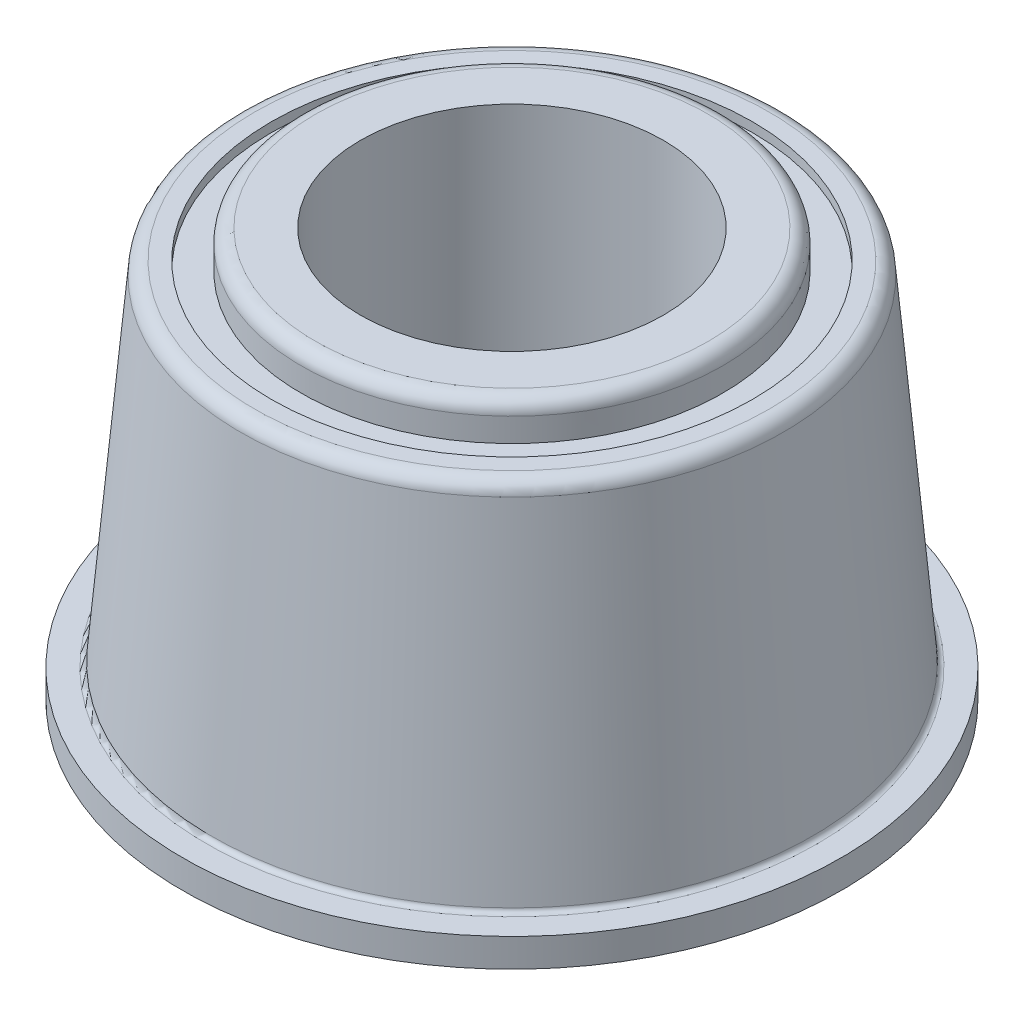
ISO-10303-21;
HEADER;
FILE_DESCRIPTION(('STEP AP214'),'2;1');
FILE_NAME('part.step','',(''),(''),'','','');
FILE_SCHEMA(('AUTOMOTIVE_DESIGN { 1 0 10303 214 1 1 1 1 }'));
ENDSEC;
DATA;
#1=APPLICATION_CONTEXT('core data for automotive mechanical design processes');
#2=APPLICATION_PROTOCOL_DEFINITION('international standard','automotive_design',2000,#1);
#3=PRODUCT_CONTEXT('',#1,'mechanical');
#4=PRODUCT('Part','Part','',(#3));
#5=PRODUCT_RELATED_PRODUCT_CATEGORY('part','',(#4));
#6=PRODUCT_DEFINITION_FORMATION('','',#4);
#7=PRODUCT_DEFINITION_CONTEXT('part definition',#1,'design');
#8=PRODUCT_DEFINITION('design','',#6,#7);
#9=PRODUCT_DEFINITION_SHAPE('','',#8);
#10=(LENGTH_UNIT() NAMED_UNIT(*) SI_UNIT(.MILLI.,.METRE.));
#11=(NAMED_UNIT(*) PLANE_ANGLE_UNIT() SI_UNIT($,.RADIAN.));
#12=(NAMED_UNIT(*) SI_UNIT($,.STERADIAN.) SOLID_ANGLE_UNIT());
#13=UNCERTAINTY_MEASURE_WITH_UNIT(LENGTH_MEASURE(1.E-05),#10,'distance_accuracy_value','');
#14=(GEOMETRIC_REPRESENTATION_CONTEXT(3) GLOBAL_UNCERTAINTY_ASSIGNED_CONTEXT((#13)) GLOBAL_UNIT_ASSIGNED_CONTEXT((#10,
#11,#12)) REPRESENTATION_CONTEXT('',''));
#15=CARTESIAN_POINT('',(0.,0.,0.));
#16=DIRECTION('',(0.,0.,1.));
#17=DIRECTION('',(1.,0.,0.));
#18=AXIS2_PLACEMENT_3D('',#15,#16,#17);
#19=CARTESIAN_POINT('',(0.,11.34,0.));
#20=DIRECTION('',(0.,-1.,0.));
#21=DIRECTION('',(0.,0.,-1.));
#22=AXIS2_PLACEMENT_3D('',#19,#20,#21);
#23=CYLINDRICAL_SURFACE('',#22,4.);
#24=CARTESIAN_POINT('',(0.,-0.750000000000001,0.));
#25=DIRECTION('',(0.,-1.,0.));
#26=DIRECTION('',(0.,0.,-1.));
#27=AXIS2_PLACEMENT_3D('',#24,#25,#26);
#28=CIRCLE('',#27,4.);
#29=CARTESIAN_POINT('',(0.,-0.750000000000001,-4.));
#30=VERTEX_POINT('',#29);
#31=EDGE_CURVE('E63',#30,#30,#28,.T.);
#32=ORIENTED_EDGE('',*,*,#31,.T.);
#33=EDGE_LOOP('',(#32));
#34=FACE_BOUND('',#33,.T.);
#35=CARTESIAN_POINT('',(0.,10.8,0.));
#36=DIRECTION('',(0.,-1.,0.));
#37=DIRECTION('',(0.,0.,-1.));
#38=AXIS2_PLACEMENT_3D('',#35,#36,#37);
#39=CIRCLE('',#38,4.);
#40=CARTESIAN_POINT('',(0.,10.8,-4.));
#41=VERTEX_POINT('',#40);
#42=EDGE_CURVE('E281',#41,#41,#39,.F.);
#43=ORIENTED_EDGE('',*,*,#42,.T.);
#44=EDGE_LOOP('',(#43));
#45=FACE_BOUND('',#44,.T.);
#46=ADVANCED_FACE('F16',(#34,#45),#23,.F.);
#47=CARTESIAN_POINT('',(0.,10.8,0.));
#48=DIRECTION('',(0.,-1.,0.));
#49=DIRECTION('',(0.,0.,-1.));
#50=AXIS2_PLACEMENT_3D('',#47,#48,#49);
#51=PLANE('',#50);
#52=ORIENTED_EDGE('',*,*,#42,.F.);
#53=EDGE_LOOP('',(#52));
#54=FACE_BOUND('',#53,.T.);
#55=CARTESIAN_POINT('',(0.,10.8,0.));
#56=DIRECTION('',(0.,-1.,0.));
#57=DIRECTION('',(-1.,0.,0.));
#58=AXIS2_PLACEMENT_3D('',#55,#56,#57);
#59=CIRCLE('',#58,5.189999901015);
#60=CARTESIAN_POINT('',(-5.189999841624,10.8,0.));
#61=VERTEX_POINT('',#60);
#62=CARTESIAN_POINT('',(5.189999841624,10.8,0.));
#63=VERTEX_POINT('',#62);
#64=EDGE_CURVE('E61',#61,#63,#59,.T.);
#65=ORIENTED_EDGE('',*,*,#64,.F.);
#66=CARTESIAN_POINT('',(0.,10.7999999999999,0.));
#67=DIRECTION('',(0.,-1.,0.));
#68=DIRECTION('',(1.,0.,0.));
#69=AXIS2_PLACEMENT_3D('',#66,#67,#68);
#70=CIRCLE('',#69,5.18999980203);
#71=EDGE_CURVE('E56',#63,#61,#70,.T.);
#72=ORIENTED_EDGE('',*,*,#71,.F.);
#73=EDGE_LOOP('',(#65,#72));
#74=FACE_BOUND('',#73,.T.);
#75=ADVANCED_FACE('F60',(#54,#74),#51,.F.);
#76=CARTESIAN_POINT('',(0.,-0.75,0.));
#77=DIRECTION('',(0.,1.,0.));
#78=DIRECTION('',(0.,0.,1.));
#79=AXIS2_PLACEMENT_3D('',#76,#77,#78);
#80=PLANE('',#79);
#81=ORIENTED_EDGE('',*,*,#31,.F.);
#82=EDGE_LOOP('',(#81));
#83=FACE_BOUND('',#82,.T.);
#84=CARTESIAN_POINT('',(0.,-0.75,0.));
#85=DIRECTION('',(0.,1.,0.));
#86=DIRECTION('',(0.,0.,1.));
#87=AXIS2_PLACEMENT_3D('',#84,#85,#86);
#88=CIRCLE('',#87,5.565);
#89=CARTESIAN_POINT('',(0.,-0.75,5.565));
#90=VERTEX_POINT('',#89);
#91=EDGE_CURVE('E68',#90,#90,#88,.T.);
#92=ORIENTED_EDGE('',*,*,#91,.F.);
#93=EDGE_LOOP('',(#92));
#94=FACE_BOUND('',#93,.T.);
#95=ADVANCED_FACE('F88',(#83,#94),#80,.F.);
#96=CARTESIAN_POINT('',(0.,10.425,0.));
#97=DIRECTION('',(0.,-1.,0.));
#98=DIRECTION('',(0.999943058778781,0.,0.0106714197806798));
#99=AXIS2_PLACEMENT_3D('',#96,#97,#98);
#100=TOROIDAL_SURFACE('',#99,5.19,0.375);
#101=CARTESIAN_POINT('',(0.,10.425,0.));
#102=DIRECTION('',(0.,-1.,0.));
#103=DIRECTION('',(0.,0.,-1.));
#104=AXIS2_PLACEMENT_3D('',#101,#102,#103);
#105=CIRCLE('',#104,5.565);
#106=CARTESIAN_POINT('',(0.,10.425,-5.565));
#107=VERTEX_POINT('',#106);
#108=EDGE_CURVE('E97',#107,#107,#105,.T.);
#109=ORIENTED_EDGE('',*,*,#108,.F.);
#110=EDGE_LOOP('',(#109));
#111=FACE_BOUND('',#110,.T.);
#112=ORIENTED_EDGE('',*,*,#64,.T.);
#113=ORIENTED_EDGE('',*,*,#71,.T.);
#114=EDGE_LOOP('',(#112,#113));
#115=FACE_BOUND('',#114,.T.);
#116=ADVANCED_FACE('F67',(#111,#115),#100,.T.);
#117=CARTESIAN_POINT('',(0.,-0.7875,0.));
#118=DIRECTION('',(0.,1.,0.));
#119=DIRECTION('',(0.,0.,1.));
#120=AXIS2_PLACEMENT_3D('',#117,#118,#119);
#121=CYLINDRICAL_SURFACE('',#120,5.565);
#122=ORIENTED_EDGE('',*,*,#91,.T.);
#123=EDGE_LOOP('',(#122));
#124=FACE_BOUND('',#123,.T.);
#125=CARTESIAN_POINT('',(0.,-0.125,0.));
#126=DIRECTION('',(0.,1.,0.));
#127=DIRECTION('',(-0.999943058778781,0.,0.0106714197806798));
#128=AXIS2_PLACEMENT_3D('',#125,#126,#127);
#129=CIRCLE('',#128,5.565);
#130=CARTESIAN_POINT('',(-5.56468312210392,-0.125,0.0593864510794831));
#131=VERTEX_POINT('',#130);
#132=EDGE_CURVE('E95',#131,#131,#129,.F.);
#133=ORIENTED_EDGE('',*,*,#132,.T.);
#134=EDGE_LOOP('',(#133));
#135=FACE_BOUND('',#134,.T.);
#136=ADVANCED_FACE('F87',(#124,#135),#121,.T.);
#137=CARTESIAN_POINT('',(0.,11.34,0.));
#138=DIRECTION('',(0.,-1.,0.));
#139=DIRECTION('',(0.,0.,-1.));
#140=AXIS2_PLACEMENT_3D('',#137,#138,#139);
#141=CYLINDRICAL_SURFACE('',#140,5.565);
#142=CARTESIAN_POINT('',(0.,9.8,0.));
#143=DIRECTION('',(0.,-1.,0.));
#144=DIRECTION('',(0.,0.,-1.));
#145=AXIS2_PLACEMENT_3D('',#142,#143,#144);
#146=CIRCLE('',#145,5.565);
#147=CARTESIAN_POINT('',(0.,9.8,-5.565));
#148=VERTEX_POINT('',#147);
#149=EDGE_CURVE('E288',#148,#148,#146,.F.);
#150=ORIENTED_EDGE('',*,*,#149,.T.);
#151=EDGE_LOOP('',(#150));
#152=FACE_BOUND('',#151,.T.);
#153=ORIENTED_EDGE('',*,*,#108,.T.);
#154=EDGE_LOOP('',(#153));
#155=FACE_BOUND('',#154,.T.);
#156=ADVANCED_FACE('F248',(#152,#155),#141,.T.);
#157=CARTESIAN_POINT('',(0.,-0.125,0.));
#158=DIRECTION('',(0.,1.,0.));
#159=DIRECTION('',(-0.999943058778781,0.,0.0106714197806798));
#160=AXIS2_PLACEMENT_3D('',#157,#158,#159);
#161=TOROIDAL_SURFACE('',#160,5.69,0.125);
#162=ORIENTED_EDGE('',*,*,#132,.F.);
#163=EDGE_LOOP('',(#162));
#164=FACE_BOUND('',#163,.T.);
#165=CARTESIAN_POINT('',(0.,0.,0.));
#166=DIRECTION('',(0.,-1.,0.));
#167=DIRECTION('',(1.,0.,0.));
#168=AXIS2_PLACEMENT_3D('',#165,#166,#167);
#169=CIRCLE('',#168,5.689999972943);
#170=CARTESIAN_POINT('',(-5.6899999810601,0.,0.));
#171=VERTEX_POINT('',#170);
#172=CARTESIAN_POINT('',(5.6899999810601,0.,0.));
#173=VERTEX_POINT('',#172);
#174=EDGE_CURVE('E215',#171,#173,#169,.F.);
#175=ORIENTED_EDGE('',*,*,#174,.F.);
#176=CARTESIAN_POINT('',(0.,0.,0.));
#177=DIRECTION('',(0.,-1.,0.));
#178=DIRECTION('',(-1.,0.,0.));
#179=AXIS2_PLACEMENT_3D('',#176,#177,#178);
#180=CIRCLE('',#179,5.6899999864715);
#181=EDGE_CURVE('E295',#173,#171,#180,.F.);
#182=ORIENTED_EDGE('',*,*,#181,.F.);
#183=EDGE_LOOP('',(#175,#182));
#184=FACE_BOUND('',#183,.T.);
#185=ADVANCED_FACE('F245',(#164,#184),#161,.F.);
#186=CARTESIAN_POINT('',(0.,9.8,0.));
#187=DIRECTION('',(0.,-1.,0.));
#188=DIRECTION('',(0.,0.,-1.));
#189=AXIS2_PLACEMENT_3D('',#186,#187,#188);
#190=PLANE('',#189);
#191=ORIENTED_EDGE('',*,*,#149,.F.);
#192=EDGE_LOOP('',(#191));
#193=FACE_BOUND('',#192,.T.);
#194=CARTESIAN_POINT('',(0.,9.8,0.));
#195=DIRECTION('',(0.,-1.,0.));
#196=DIRECTION('',(0.,0.,-1.));
#197=AXIS2_PLACEMENT_3D('',#194,#195,#196);
#198=CIRCLE('',#197,6.350677714604);
#199=CARTESIAN_POINT('',(0.,9.8,-6.350677714604));
#200=VERTEX_POINT('',#199);
#201=EDGE_CURVE('E291',#200,#200,#198,.F.);
#202=ORIENTED_EDGE('',*,*,#201,.T.);
#203=EDGE_LOOP('',(#202));
#204=FACE_BOUND('',#203,.T.);
#205=ADVANCED_FACE('F232',(#193,#204),#190,.F.);
#206=CARTESIAN_POINT('',(0.,0.,0.));
#207=DIRECTION('',(0.,-1.,0.));
#208=DIRECTION('',(0.,0.,-1.));
#209=AXIS2_PLACEMENT_3D('',#206,#207,#208);
#210=PLANE('',#209);
#211=ORIENTED_EDGE('',*,*,#174,.T.);
#212=ORIENTED_EDGE('',*,*,#181,.T.);
#213=EDGE_LOOP('',(#211,#212));
#214=FACE_BOUND('',#213,.T.);
#215=CARTESIAN_POINT('',(0.,0.,0.));
#216=DIRECTION('',(0.,-1.,0.));
#217=DIRECTION('',(0.,0.,-1.));
#218=AXIS2_PLACEMENT_3D('',#215,#216,#217);
#219=CIRCLE('',#218,8.7);
#220=CARTESIAN_POINT('',(0.,0.,-8.7));
#221=VERTEX_POINT('',#220);
#222=EDGE_CURVE('E294',#221,#221,#219,.F.);
#223=ORIENTED_EDGE('',*,*,#222,.F.);
#224=EDGE_LOOP('',(#223));
#225=FACE_BOUND('',#224,.T.);
#226=ADVANCED_FACE('F221',(#214,#225),#210,.T.);
#227=CARTESIAN_POINT('',(0.,10.0625,0.));
#228=DIRECTION('',(0.,-1.,0.));
#229=DIRECTION('',(0.,0.,-1.));
#230=AXIS2_PLACEMENT_3D('',#227,#228,#229);
#231=CYLINDRICAL_SURFACE('',#230,6.350677714604);
#232=ORIENTED_EDGE('',*,*,#201,.F.);
#233=EDGE_LOOP('',(#232));
#234=FACE_BOUND('',#233,.T.);
#235=CARTESIAN_POINT('',(0.,10.05,0.));
#236=DIRECTION('',(0.,-1.,0.));
#237=DIRECTION('',(0.,0.,-1.));
#238=AXIS2_PLACEMENT_3D('',#235,#236,#237);
#239=CIRCLE('',#238,6.350677714604);
#240=CARTESIAN_POINT('',(0.,10.05,-6.350677714604));
#241=VERTEX_POINT('',#240);
#242=EDGE_CURVE('E297',#241,#241,#239,.F.);
#243=ORIENTED_EDGE('',*,*,#242,.T.);
#244=EDGE_LOOP('',(#243));
#245=FACE_BOUND('',#244,.T.);
#246=ADVANCED_FACE('F231',(#234,#245),#231,.F.);
#247=CARTESIAN_POINT('',(0.,11.34,0.));
#248=DIRECTION('',(0.,-1.,0.));
#249=DIRECTION('',(0.,0.,-1.));
#250=AXIS2_PLACEMENT_3D('',#247,#248,#249);
#251=CYLINDRICAL_SURFACE('',#250,8.7);
#252=ORIENTED_EDGE('',*,*,#222,.T.);
#253=EDGE_LOOP('',(#252));
#254=FACE_BOUND('',#253,.T.);
#255=CARTESIAN_POINT('',(0.,0.750000000000001,0.));
#256=DIRECTION('',(0.,-1.,0.));
#257=DIRECTION('',(0.,0.,-1.));
#258=AXIS2_PLACEMENT_3D('',#255,#256,#257);
#259=CIRCLE('',#258,8.7);
#260=CARTESIAN_POINT('',(0.,0.750000000000001,-8.7));
#261=VERTEX_POINT('',#260);
#262=EDGE_CURVE('E75',#261,#261,#259,.T.);
#263=ORIENTED_EDGE('',*,*,#262,.T.);
#264=EDGE_LOOP('',(#263));
#265=FACE_BOUND('',#264,.T.);
#266=ADVANCED_FACE('F304',(#254,#265),#251,.T.);
#267=CARTESIAN_POINT('',(0.,10.05,0.));
#268=DIRECTION('',(0.,-1.,0.));
#269=DIRECTION('',(0.,0.,-1.));
#270=AXIS2_PLACEMENT_3D('',#267,#268,#269);
#271=PLANE('',#270);
#272=ORIENTED_EDGE('',*,*,#242,.F.);
#273=EDGE_LOOP('',(#272));
#274=FACE_BOUND('',#273,.T.);
#275=CARTESIAN_POINT('',(0.,10.05,0.));
#276=DIRECTION('',(0.,-1.,0.));
#277=DIRECTION('',(-1.,0.,0.));
#278=AXIS2_PLACEMENT_3D('',#275,#276,#277);
#279=CIRCLE('',#278,6.7927312047305);
#280=CARTESIAN_POINT('',(-6.7927311841976,10.05,0.));
#281=VERTEX_POINT('',#280);
#282=CARTESIAN_POINT('',(6.7927311841976,10.05,0.));
#283=VERTEX_POINT('',#282);
#284=EDGE_CURVE('E181',#281,#283,#279,.T.);
#285=ORIENTED_EDGE('',*,*,#284,.F.);
#286=CARTESIAN_POINT('',(0.,10.05,0.));
#287=DIRECTION('',(0.,-1.,0.));
#288=DIRECTION('',(1.,0.,0.));
#289=AXIS2_PLACEMENT_3D('',#286,#287,#288);
#290=CIRCLE('',#289,6.792731170509);
#291=EDGE_CURVE('E191',#283,#281,#290,.T.);
#292=ORIENTED_EDGE('',*,*,#291,.F.);
#293=EDGE_LOOP('',(#285,#292));
#294=FACE_BOUND('',#293,.T.);
#295=ADVANCED_FACE('F157',(#274,#294),#271,.F.);
#296=CARTESIAN_POINT('',(0.,0.75,0.));
#297=DIRECTION('',(0.,-1.,0.));
#298=DIRECTION('',(0.,0.,-1.));
#299=AXIS2_PLACEMENT_3D('',#296,#297,#298);
#300=PLANE('',#299);
#301=CARTESIAN_POINT('',(0.,0.75,0.));
#302=DIRECTION('',(0.,1.,0.));
#303=DIRECTION('',(1.,0.,0.));
#304=AXIS2_PLACEMENT_3D('',#301,#302,#303);
#305=CIRCLE('',#304,8.064541404264);
#306=CARTESIAN_POINT('',(-8.0645414072688,0.75,0.));
#307=VERTEX_POINT('',#306);
#308=CARTESIAN_POINT('',(8.0645414072688,0.75,0.));
#309=VERTEX_POINT('',#308);
#310=EDGE_CURVE('E143',#307,#309,#305,.F.);
#311=ORIENTED_EDGE('',*,*,#310,.T.);
#312=CARTESIAN_POINT('',(0.,0.750000000000001,0.));
#313=DIRECTION('',(0.,1.,0.));
#314=DIRECTION('',(-1.,0.,0.));
#315=AXIS2_PLACEMENT_3D('',#312,#313,#314);
#316=CIRCLE('',#315,8.064541411776);
#317=EDGE_CURVE('E35',#307,#309,#316,.T.);
#318=ORIENTED_EDGE('',*,*,#317,.F.);
#319=EDGE_LOOP('',(#311,#318));
#320=FACE_BOUND('',#319,.T.);
#321=ORIENTED_EDGE('',*,*,#262,.F.);
#322=EDGE_LOOP('',(#321));
#323=FACE_BOUND('',#322,.T.);
#324=ADVANCED_FACE('F148',(#320,#323),#300,.F.);
#325=CARTESIAN_POINT('',(0.,9.675,0.));
#326=DIRECTION('',(0.,-1.,0.));
#327=DIRECTION('',(0.999969007949321,0.,0.00787293724416117));
#328=AXIS2_PLACEMENT_3D('',#325,#326,#327);
#329=TOROIDAL_SURFACE('',#328,6.792731238952,0.375);
#330=CARTESIAN_POINT('',(0.,9.70768341043103,0.));
#331=DIRECTION('',(0.,-1.,0.));
#332=DIRECTION('',(-1.,0.,0.));
#333=AXIS2_PLACEMENT_3D('',#330,#331,#332);
#334=CIRCLE('',#333,7.16630425013327);
#335=CARTESIAN_POINT('',(-7.16630425013327,9.70768341043103,0.));
#336=VERTEX_POINT('',#335);
#337=EDGE_CURVE('E27',#336,#336,#334,.T.);
#338=ORIENTED_EDGE('',*,*,#337,.F.);
#339=EDGE_LOOP('',(#338));
#340=FACE_BOUND('',#339,.T.);
#341=ORIENTED_EDGE('',*,*,#284,.T.);
#342=ORIENTED_EDGE('',*,*,#291,.T.);
#343=EDGE_LOOP('',(#341,#342));
#344=FACE_BOUND('',#343,.T.);
#345=ADVANCED_FACE('F126',(#340,#344),#329,.T.);
#346=CARTESIAN_POINT('',(0.,0.875,0.));
#347=DIRECTION('',(0.,-1.,0.));
#348=DIRECTION('',(-0.999983191684538,0.,0.00579796071090922));
#349=AXIS2_PLACEMENT_3D('',#346,#347,#348);
#350=TOROIDAL_SURFACE('',#349,8.064541396752,0.125);
#351=ORIENTED_EDGE('',*,*,#317,.T.);
#352=ORIENTED_EDGE('',*,*,#310,.F.);
#353=EDGE_LOOP('',(#351,#352));
#354=FACE_BOUND('',#353,.T.);
#355=CARTESIAN_POINT('',(0.,0.864105530887782,0.));
#356=DIRECTION('',(0.,-1.,0.));
#357=DIRECTION('',(-1.,0.,0.));
#358=AXIS2_PLACEMENT_3D('',#355,#356,#357);
#359=CIRCLE('',#358,7.94001705960179);
#360=CARTESIAN_POINT('',(-7.94001705960179,0.864105530887781,0.));
#361=VERTEX_POINT('',#360);
#362=EDGE_CURVE('E10',#361,#361,#359,.F.);
#363=ORIENTED_EDGE('',*,*,#362,.F.);
#364=EDGE_LOOP('',(#363));
#365=FACE_BOUND('',#364,.T.);
#366=ADVANCED_FACE('F120',(#354,#365),#350,.F.);
#367=CARTESIAN_POINT('',(0.,0.864105530887782,0.));
#368=DIRECTION('',(0.,-1.,0.));
#369=DIRECTION('',(0.,0.,-1.));
#370=AXIS2_PLACEMENT_3D('',#367,#368,#369);
#371=CONICAL_SURFACE('',#370,7.94001705960179,0.0872664625996999);
#372=ORIENTED_EDGE('',*,*,#337,.T.);
#373=EDGE_LOOP('',(#372));
#374=FACE_BOUND('',#373,.T.);
#375=ORIENTED_EDGE('',*,*,#362,.T.);
#376=EDGE_LOOP('',(#375));
#377=FACE_BOUND('',#376,.T.);
#378=ADVANCED_FACE('F118',(#374,#377),#371,.T.);
#379=CLOSED_SHELL('',(#46,#75,#95,#116,#136,#156,#185,#205,#226,#246,#266,#295,#324,#345,#366,#378));
#380=MANIFOLD_SOLID_BREP('B1',#379);
#381=ADVANCED_BREP_SHAPE_REPRESENTATION('',(#18,#380),#14);
#382=SHAPE_DEFINITION_REPRESENTATION(#9,#381);
ENDSEC;
END-ISO-10303-21;
